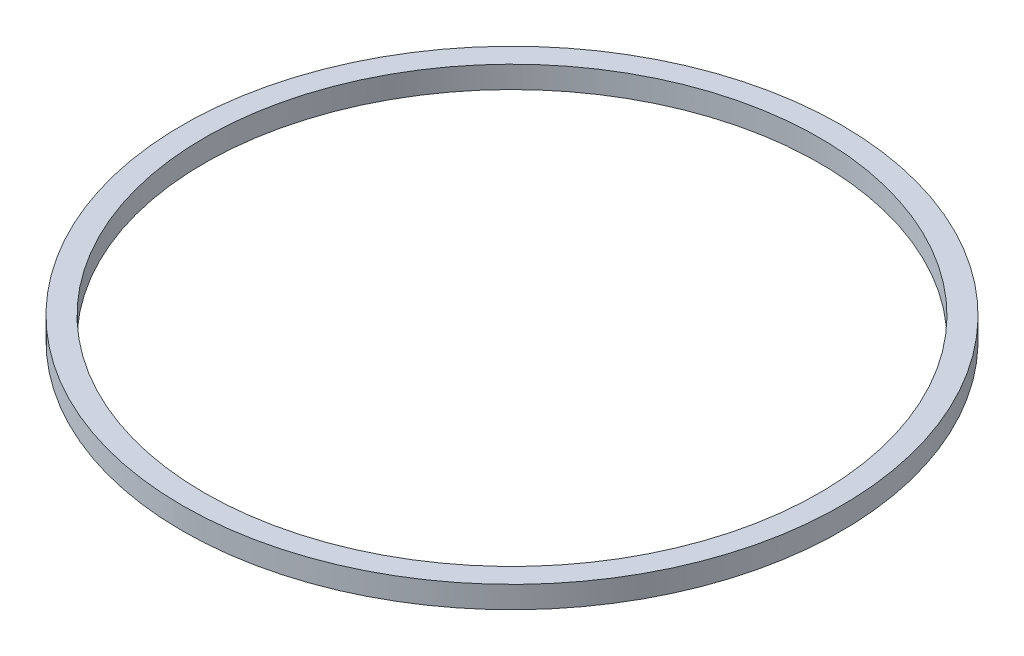
ISO-10303-21;
HEADER;
FILE_DESCRIPTION(('STEP AP214'),'2;1');
FILE_NAME('part.step','',(''),(''),'','','');
FILE_SCHEMA(('AUTOMOTIVE_DESIGN { 1 0 10303 214 1 1 1 1 }'));
ENDSEC;
DATA;
#1=APPLICATION_CONTEXT('core data for automotive mechanical design processes');
#2=APPLICATION_PROTOCOL_DEFINITION('international standard','automotive_design',2000,#1);
#3=PRODUCT_CONTEXT('',#1,'mechanical');
#4=PRODUCT('Part','Part','',(#3));
#5=PRODUCT_RELATED_PRODUCT_CATEGORY('part','',(#4));
#6=PRODUCT_DEFINITION_FORMATION('','',#4);
#7=PRODUCT_DEFINITION_CONTEXT('part definition',#1,'design');
#8=PRODUCT_DEFINITION('design','',#6,#7);
#9=PRODUCT_DEFINITION_SHAPE('','',#8);
#10=(LENGTH_UNIT() NAMED_UNIT(*) SI_UNIT(.MILLI.,.METRE.));
#11=(NAMED_UNIT(*) PLANE_ANGLE_UNIT() SI_UNIT($,.RADIAN.));
#12=(NAMED_UNIT(*) SI_UNIT($,.STERADIAN.) SOLID_ANGLE_UNIT());
#13=UNCERTAINTY_MEASURE_WITH_UNIT(LENGTH_MEASURE(1.E-05),#10,'distance_accuracy_value','');
#14=(GEOMETRIC_REPRESENTATION_CONTEXT(3) GLOBAL_UNCERTAINTY_ASSIGNED_CONTEXT((#13)) GLOBAL_UNIT_ASSIGNED_CONTEXT((#10,
#11,#12)) REPRESENTATION_CONTEXT('',''));
#15=CARTESIAN_POINT('',(0.,0.,0.));
#16=DIRECTION('',(0.,0.,1.));
#17=DIRECTION('',(1.,0.,0.));
#18=AXIS2_PLACEMENT_3D('',#15,#16,#17);
#19=CARTESIAN_POINT('',(64.0044876878217,2.54,-73.6932404112076));
#20=DIRECTION('',(0.,1.,0.));
#21=DIRECTION('',(0.,0.,1.));
#22=AXIS2_PLACEMENT_3D('',#19,#20,#21);
#23=PLANE('',#22);
#24=CARTESIAN_POINT('',(64.0044876878217,2.54,-73.6932404112076));
#25=DIRECTION('',(0.,1.,0.));
#26=DIRECTION('',(0.,0.,1.));
#27=AXIS2_PLACEMENT_3D('',#24,#25,#26);
#28=CIRCLE('',#27,38.1);
#29=CARTESIAN_POINT('',(64.0044876878217,2.54,-35.5932404112076));
#30=VERTEX_POINT('',#29);
#31=EDGE_CURVE('E10',#30,#30,#28,.T.);
#32=ORIENTED_EDGE('',*,*,#31,.T.);
#33=EDGE_LOOP('',(#32));
#34=FACE_BOUND('',#33,.T.);
#35=CARTESIAN_POINT('',(64.0044876878217,2.54,-73.6932404112076));
#36=DIRECTION('',(0.,1.,0.));
#37=DIRECTION('',(0.,0.,1.));
#38=AXIS2_PLACEMENT_3D('',#35,#36,#37);
#39=CIRCLE('',#38,35.56);
#40=CARTESIAN_POINT('',(64.0044876878217,2.54,-38.1332404112076));
#41=VERTEX_POINT('',#40);
#42=EDGE_CURVE('E42',#41,#41,#39,.T.);
#43=ORIENTED_EDGE('',*,*,#42,.F.);
#44=EDGE_LOOP('',(#43));
#45=FACE_BOUND('',#44,.T.);
#46=ADVANCED_FACE('F31',(#34,#45),#23,.T.);
#47=CARTESIAN_POINT('',(64.0044876878217,0.,-73.6932404112076));
#48=DIRECTION('',(0.,1.,0.));
#49=DIRECTION('',(0.,0.,1.));
#50=AXIS2_PLACEMENT_3D('',#47,#48,#49);
#51=PLANE('',#50);
#52=CARTESIAN_POINT('',(64.0044876878217,0.,-73.6932404112076));
#53=DIRECTION('',(0.,1.,0.));
#54=DIRECTION('',(0.,0.,1.));
#55=AXIS2_PLACEMENT_3D('',#52,#53,#54);
#56=CIRCLE('',#55,38.1);
#57=CARTESIAN_POINT('',(64.0044876878217,0.,-35.5932404112076));
#58=VERTEX_POINT('',#57);
#59=EDGE_CURVE('E35',#58,#58,#56,.T.);
#60=ORIENTED_EDGE('',*,*,#59,.F.);
#61=EDGE_LOOP('',(#60));
#62=FACE_BOUND('',#61,.T.);
#63=CARTESIAN_POINT('',(64.0044876878217,0.,-73.6932404112076));
#64=DIRECTION('',(0.,1.,0.));
#65=DIRECTION('',(0.,0.,1.));
#66=AXIS2_PLACEMENT_3D('',#63,#64,#65);
#67=CIRCLE('',#66,35.56);
#68=CARTESIAN_POINT('',(64.0044876878217,0.,-38.1332404112076));
#69=VERTEX_POINT('',#68);
#70=EDGE_CURVE('E44',#69,#69,#67,.T.);
#71=ORIENTED_EDGE('',*,*,#70,.T.);
#72=EDGE_LOOP('',(#71));
#73=FACE_BOUND('',#72,.T.);
#74=ADVANCED_FACE('F54',(#62,#73),#51,.F.);
#75=CARTESIAN_POINT('',(64.0044876878217,2.54,-73.6932404112076));
#76=DIRECTION('',(0.,-1.,0.));
#77=DIRECTION('',(0.,0.,-1.));
#78=AXIS2_PLACEMENT_3D('',#75,#76,#77);
#79=CYLINDRICAL_SURFACE('',#78,38.1);
#80=ORIENTED_EDGE('',*,*,#31,.F.);
#81=EDGE_LOOP('',(#80));
#82=FACE_BOUND('',#81,.T.);
#83=ORIENTED_EDGE('',*,*,#59,.T.);
#84=EDGE_LOOP('',(#83));
#85=FACE_BOUND('',#84,.T.);
#86=ADVANCED_FACE('F33',(#82,#85),#79,.T.);
#87=CARTESIAN_POINT('',(64.0044876878217,2.54,-73.6932404112076));
#88=DIRECTION('',(0.,-1.,0.));
#89=DIRECTION('',(0.,0.,-1.));
#90=AXIS2_PLACEMENT_3D('',#87,#88,#89);
#91=CYLINDRICAL_SURFACE('',#90,35.56);
#92=ORIENTED_EDGE('',*,*,#42,.T.);
#93=EDGE_LOOP('',(#92));
#94=FACE_BOUND('',#93,.T.);
#95=ORIENTED_EDGE('',*,*,#70,.F.);
#96=EDGE_LOOP('',(#95));
#97=FACE_BOUND('',#96,.T.);
#98=ADVANCED_FACE('F50',(#94,#97),#91,.F.);
#99=CLOSED_SHELL('',(#46,#74,#86,#98));
#100=MANIFOLD_SOLID_BREP('B2',#99);
#101=ADVANCED_BREP_SHAPE_REPRESENTATION('',(#18,#100),#14);
#102=SHAPE_DEFINITION_REPRESENTATION(#9,#101);
ENDSEC;
END-ISO-10303-21;
